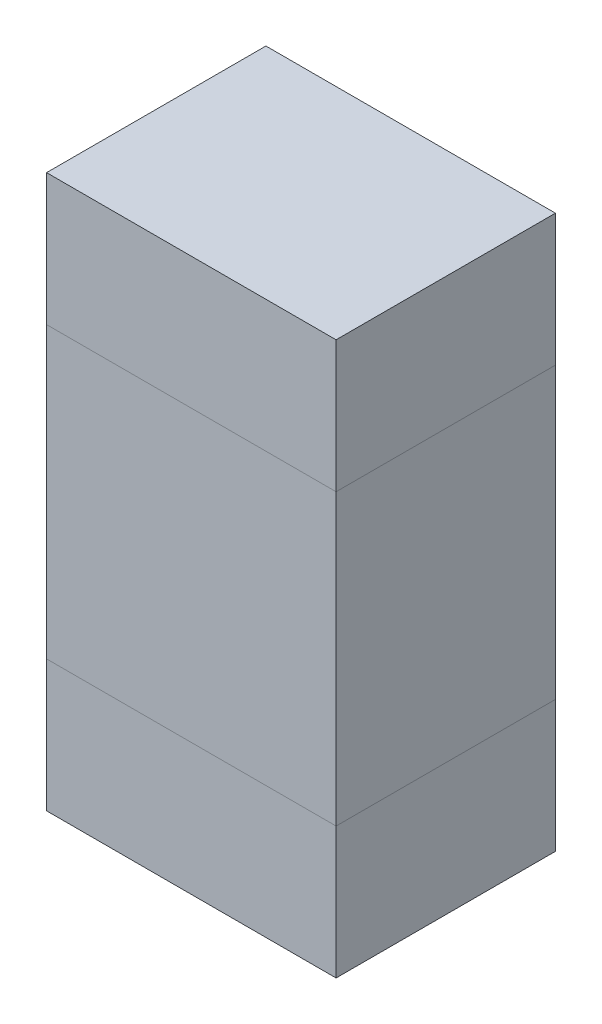
ISO-10303-21;
HEADER;
FILE_DESCRIPTION(('STEP AP214'),'2;1');
FILE_NAME('part.step','',(''),(''),'','','');
FILE_SCHEMA(('AUTOMOTIVE_DESIGN { 1 0 10303 214 1 1 1 1 }'));
ENDSEC;
DATA;
#1=APPLICATION_CONTEXT('core data for automotive mechanical design processes');
#2=APPLICATION_PROTOCOL_DEFINITION('international standard','automotive_design',2000,#1);
#3=PRODUCT_CONTEXT('',#1,'mechanical');
#4=PRODUCT('Part','Part','',(#3));
#5=PRODUCT_RELATED_PRODUCT_CATEGORY('part','',(#4));
#6=PRODUCT_DEFINITION_FORMATION('','',#4);
#7=PRODUCT_DEFINITION_CONTEXT('part definition',#1,'design');
#8=PRODUCT_DEFINITION('design','',#6,#7);
#9=PRODUCT_DEFINITION_SHAPE('','',#8);
#10=(LENGTH_UNIT() NAMED_UNIT(*) SI_UNIT(.MILLI.,.METRE.));
#11=(NAMED_UNIT(*) PLANE_ANGLE_UNIT() SI_UNIT($,.RADIAN.));
#12=(NAMED_UNIT(*) SI_UNIT($,.STERADIAN.) SOLID_ANGLE_UNIT());
#13=UNCERTAINTY_MEASURE_WITH_UNIT(LENGTH_MEASURE(1.E-05),#10,'distance_accuracy_value','');
#14=(GEOMETRIC_REPRESENTATION_CONTEXT(3) GLOBAL_UNCERTAINTY_ASSIGNED_CONTEXT((#13)) GLOBAL_UNIT_ASSIGNED_CONTEXT((#10,
#11,#12)) REPRESENTATION_CONTEXT('',''));
#15=CARTESIAN_POINT('',(0.,0.,0.));
#16=DIRECTION('',(0.,0.,1.));
#17=DIRECTION('',(1.,0.,0.));
#18=AXIS2_PLACEMENT_3D('',#15,#16,#17);
#19=CARTESIAN_POINT('',(4.114996417695,8.984999960195,0.2499995));
#20=DIRECTION('',(0.,0.,-1.));
#21=DIRECTION('',(0.,-1.,0.));
#22=AXIS2_PLACEMENT_3D('',#19,#20,#21);
#23=PLANE('',#22);
#24=DIRECTION('',(0.,1.,0.));
#25=VECTOR('',#24,1.);
#26=CARTESIAN_POINT('',(4.114996417695,8.984999960195,0.2499995));
#27=LINE('',#26,#25);
#28=CARTESIAN_POINT('',(4.114996417695,8.984999960195,0.2499995));
#29=VERTEX_POINT('',#28);
#30=CARTESIAN_POINT('',(4.114996417695,9.314996760195,0.2499995));
#31=VERTEX_POINT('',#30);
#32=EDGE_CURVE('P0_E94',#29,#31,#27,.T.);
#33=ORIENTED_EDGE('',*,*,#32,.T.);
#34=DIRECTION('',(-1.,0.,0.));
#35=VECTOR('',#34,1.);
#36=CARTESIAN_POINT('',(4.114996417695,9.314996760195,0.2499995));
#37=LINE('',#36,#35);
#38=CARTESIAN_POINT('',(3.785002157695,9.314996760195,0.2499995));
#39=VERTEX_POINT('',#38);
#40=EDGE_CURVE('P0_E74',#31,#39,#37,.T.);
#41=ORIENTED_EDGE('',*,*,#40,.T.);
#42=DIRECTION('',(0.,-1.,0.));
#43=VECTOR('',#42,1.);
#44=CARTESIAN_POINT('',(3.785002157695,9.314996760195,0.2499995));
#45=LINE('',#44,#43);
#46=CARTESIAN_POINT('',(3.785002157695,8.984999960195,0.2499995));
#47=VERTEX_POINT('',#46);
#48=EDGE_CURVE('P0_E88',#39,#47,#45,.T.);
#49=ORIENTED_EDGE('',*,*,#48,.T.);
#50=DIRECTION('',(1.,0.,0.));
#51=VECTOR('',#50,1.);
#52=CARTESIAN_POINT('',(3.785002157695,8.984999960195,0.2499995));
#53=LINE('',#52,#51);
#54=EDGE_CURVE('P0_E11',#47,#29,#53,.T.);
#55=ORIENTED_EDGE('',*,*,#54,.T.);
#56=EDGE_LOOP('',(#33,#41,#49,#55));
#57=FACE_BOUND('',#56,.T.);
#58=ADVANCED_FACE('P0_F17',(#57),#23,.F.);
#59=CARTESIAN_POINT('',(4.114996417695,8.984999960195,0.));
#60=DIRECTION('',(0.,0.,-1.));
#61=DIRECTION('',(0.,-1.,0.));
#62=AXIS2_PLACEMENT_3D('',#59,#60,#61);
#63=PLANE('',#62);
#64=DIRECTION('',(1.,0.,0.));
#65=VECTOR('',#64,1.);
#66=CARTESIAN_POINT('',(3.785002157695,8.984999960195,0.));
#67=LINE('',#66,#65);
#68=CARTESIAN_POINT('',(3.785002157695,8.984999960195,0.));
#69=VERTEX_POINT('',#68);
#70=CARTESIAN_POINT('',(4.114996417695,8.984999960195,0.));
#71=VERTEX_POINT('',#70);
#72=EDGE_CURVE('P0_E21',#69,#71,#67,.T.);
#73=ORIENTED_EDGE('',*,*,#72,.F.);
#74=DIRECTION('',(0.,-1.,0.));
#75=VECTOR('',#74,1.);
#76=CARTESIAN_POINT('',(3.785002157695,9.314996760195,0.));
#77=LINE('',#76,#75);
#78=CARTESIAN_POINT('',(3.785002157695,9.314996760195,0.));
#79=VERTEX_POINT('',#78);
#80=EDGE_CURVE('P0_E59',#79,#69,#77,.T.);
#81=ORIENTED_EDGE('',*,*,#80,.F.);
#82=DIRECTION('',(-1.,0.,0.));
#83=VECTOR('',#82,1.);
#84=CARTESIAN_POINT('',(4.114996417695,9.314996760195,0.));
#85=LINE('',#84,#83);
#86=CARTESIAN_POINT('',(4.114996417695,9.314996760195,0.));
#87=VERTEX_POINT('',#86);
#88=EDGE_CURVE('P0_E96',#87,#79,#85,.T.);
#89=ORIENTED_EDGE('',*,*,#88,.F.);
#90=DIRECTION('',(0.,1.,0.));
#91=VECTOR('',#90,1.);
#92=CARTESIAN_POINT('',(4.114996417695,8.984999960195,0.));
#93=LINE('',#92,#91);
#94=EDGE_CURVE('P0_E93',#71,#87,#93,.T.);
#95=ORIENTED_EDGE('',*,*,#94,.F.);
#96=EDGE_LOOP('',(#73,#81,#89,#95));
#97=FACE_BOUND('',#96,.T.);
#98=ADVANCED_FACE('P0_F19',(#97),#63,.T.);
#99=CARTESIAN_POINT('',(3.785002157695,8.984999960195,0.));
#100=DIRECTION('',(0.,1.,0.));
#101=DIRECTION('',(1.,0.,0.));
#102=AXIS2_PLACEMENT_3D('',#99,#100,#101);
#103=PLANE('',#102);
#104=ORIENTED_EDGE('',*,*,#72,.T.);
#105=DIRECTION('',(0.,0.,1.));
#106=VECTOR('',#105,1.);
#107=CARTESIAN_POINT('',(4.114996417695,8.984999960195,0.));
#108=LINE('',#107,#106);
#109=EDGE_CURVE('P0_E83',#71,#29,#108,.T.);
#110=ORIENTED_EDGE('',*,*,#109,.T.);
#111=ORIENTED_EDGE('',*,*,#54,.F.);
#112=DIRECTION('',(0.,0.,1.));
#113=VECTOR('',#112,1.);
#114=CARTESIAN_POINT('',(3.785002157695,8.984999960195,0.));
#115=LINE('',#114,#113);
#116=EDGE_CURVE('P0_E86',#69,#47,#115,.T.);
#117=ORIENTED_EDGE('',*,*,#116,.F.);
#118=EDGE_LOOP('',(#104,#110,#111,#117));
#119=FACE_BOUND('',#118,.T.);
#120=ADVANCED_FACE('P0_F82',(#119),#103,.F.);
#121=CARTESIAN_POINT('',(3.785002157695,9.314996760195,0.));
#122=DIRECTION('',(1.,0.,0.));
#123=DIRECTION('',(0.,1.,0.));
#124=AXIS2_PLACEMENT_3D('',#121,#122,#123);
#125=PLANE('',#124);
#126=ORIENTED_EDGE('',*,*,#80,.T.);
#127=ORIENTED_EDGE('',*,*,#116,.T.);
#128=ORIENTED_EDGE('',*,*,#48,.F.);
#129=DIRECTION('',(0.,0.,1.));
#130=VECTOR('',#129,1.);
#131=CARTESIAN_POINT('',(3.785002157695,9.314996760195,0.));
#132=LINE('',#131,#130);
#133=EDGE_CURVE('P0_E109',#79,#39,#132,.T.);
#134=ORIENTED_EDGE('',*,*,#133,.F.);
#135=EDGE_LOOP('',(#126,#127,#128,#134));
#136=FACE_BOUND('',#135,.T.);
#137=ADVANCED_FACE('P0_F121',(#136),#125,.F.);
#138=CARTESIAN_POINT('',(4.114996417695,9.314996760195,0.));
#139=DIRECTION('',(0.,-1.,0.));
#140=DIRECTION('',(0.,0.,-1.));
#141=AXIS2_PLACEMENT_3D('',#138,#139,#140);
#142=PLANE('',#141);
#143=ORIENTED_EDGE('',*,*,#88,.T.);
#144=ORIENTED_EDGE('',*,*,#133,.T.);
#145=ORIENTED_EDGE('',*,*,#40,.F.);
#146=DIRECTION('',(0.,0.,1.));
#147=VECTOR('',#146,1.);
#148=CARTESIAN_POINT('',(4.114996417695,9.314996760195,0.));
#149=LINE('',#148,#147);
#150=EDGE_CURVE('P0_E100',#87,#31,#149,.T.);
#151=ORIENTED_EDGE('',*,*,#150,.F.);
#152=EDGE_LOOP('',(#143,#144,#145,#151));
#153=FACE_BOUND('',#152,.T.);
#154=ADVANCED_FACE('P0_F122',(#153),#142,.F.);
#155=CARTESIAN_POINT('',(4.114996417695,8.984999960195,0.));
#156=DIRECTION('',(-1.,0.,0.));
#157=DIRECTION('',(0.,0.,1.));
#158=AXIS2_PLACEMENT_3D('',#155,#156,#157);
#159=PLANE('',#158);
#160=ORIENTED_EDGE('',*,*,#94,.T.);
#161=ORIENTED_EDGE('',*,*,#150,.T.);
#162=ORIENTED_EDGE('',*,*,#32,.F.);
#163=ORIENTED_EDGE('',*,*,#109,.F.);
#164=EDGE_LOOP('',(#160,#161,#162,#163));
#165=FACE_BOUND('',#164,.T.);
#166=ADVANCED_FACE('P0_F91',(#165),#159,.F.);
#167=CLOSED_SHELL('',(#58,#98,#120,#137,#154,#166));
#168=MANIFOLD_SOLID_BREP('P0_B1',#167);
#169=CARTESIAN_POINT('',(4.114996417695,8.985004156426,0.2499995));
#170=DIRECTION('',(0.,0.,-1.));
#171=DIRECTION('',(0.,-1.,0.));
#172=AXIS2_PLACEMENT_3D('',#169,#170,#171);
#173=PLANE('',#172);
#174=DIRECTION('',(-1.,0.,0.));
#175=VECTOR('',#174,1.);
#176=CARTESIAN_POINT('',(4.114996417695,8.985004156426,0.2499995));
#177=LINE('',#176,#175);
#178=CARTESIAN_POINT('',(4.114996417695,8.985004156426,0.2499995));
#179=VERTEX_POINT('',#178);
#180=CARTESIAN_POINT('',(3.784999617695,8.985004156426,0.2499995));
#181=VERTEX_POINT('',#180);
#182=EDGE_CURVE('P1_E90',#179,#181,#177,.T.);
#183=ORIENTED_EDGE('',*,*,#182,.T.);
#184=DIRECTION('',(0.,-1.,0.));
#185=VECTOR('',#184,1.);
#186=CARTESIAN_POINT('',(3.784999617695,8.985004156426,0.2499995));
#187=LINE('',#186,#185);
#188=CARTESIAN_POINT('',(3.784999617695,8.834996836426,0.2499995));
#189=VERTEX_POINT('',#188);
#190=EDGE_CURVE('P1_E85',#181,#189,#187,.T.);
#191=ORIENTED_EDGE('',*,*,#190,.T.);
#192=DIRECTION('',(1.,0.,0.));
#193=VECTOR('',#192,1.);
#194=CARTESIAN_POINT('',(3.784999617695,8.834996836426,0.2499995));
#195=LINE('',#194,#193);
#196=CARTESIAN_POINT('',(4.114996417695,8.834996836426,0.2499995));
#197=VERTEX_POINT('',#196);
#198=EDGE_CURVE('P1_E103',#189,#197,#195,.T.);
#199=ORIENTED_EDGE('',*,*,#198,.T.);
#200=DIRECTION('',(0.,1.,0.));
#201=VECTOR('',#200,1.);
#202=CARTESIAN_POINT('',(4.114996417695,8.834996836426,0.2499995));
#203=LINE('',#202,#201);
#204=EDGE_CURVE('P1_E11',#197,#179,#203,.T.);
#205=ORIENTED_EDGE('',*,*,#204,.T.);
#206=EDGE_LOOP('',(#183,#191,#199,#205));
#207=FACE_BOUND('',#206,.T.);
#208=ADVANCED_FACE('P1_F17',(#207),#173,.F.);
#209=CARTESIAN_POINT('',(4.114996417695,8.985004156426,0.));
#210=DIRECTION('',(0.,0.,-1.));
#211=DIRECTION('',(0.,-1.,0.));
#212=AXIS2_PLACEMENT_3D('',#209,#210,#211);
#213=PLANE('',#212);
#214=DIRECTION('',(0.,1.,0.));
#215=VECTOR('',#214,1.);
#216=CARTESIAN_POINT('',(4.114996417695,8.834996836426,0.));
#217=LINE('',#216,#215);
#218=CARTESIAN_POINT('',(4.114996417695,8.834996836426,0.));
#219=VERTEX_POINT('',#218);
#220=CARTESIAN_POINT('',(4.114996417695,8.985004156426,0.));
#221=VERTEX_POINT('',#220);
#222=EDGE_CURVE('P1_E25',#219,#221,#217,.T.);
#223=ORIENTED_EDGE('',*,*,#222,.F.);
#224=DIRECTION('',(1.,0.,0.));
#225=VECTOR('',#224,1.);
#226=CARTESIAN_POINT('',(3.784999617695,8.834996836426,0.));
#227=LINE('',#226,#225);
#228=CARTESIAN_POINT('',(3.784999617695,8.834996836426,0.));
#229=VERTEX_POINT('',#228);
#230=EDGE_CURVE('P1_E73',#229,#219,#227,.T.);
#231=ORIENTED_EDGE('',*,*,#230,.F.);
#232=DIRECTION('',(0.,-1.,0.));
#233=VECTOR('',#232,1.);
#234=CARTESIAN_POINT('',(3.784999617695,8.985004156426,0.));
#235=LINE('',#234,#233);
#236=CARTESIAN_POINT('',(3.784999617695,8.985004156426,0.));
#237=VERTEX_POINT('',#236);
#238=EDGE_CURVE('P1_E67',#237,#229,#235,.T.);
#239=ORIENTED_EDGE('',*,*,#238,.F.);
#240=DIRECTION('',(-1.,0.,0.));
#241=VECTOR('',#240,1.);
#242=CARTESIAN_POINT('',(4.114996417695,8.985004156426,0.));
#243=LINE('',#242,#241);
#244=EDGE_CURVE('P1_E71',#221,#237,#243,.T.);
#245=ORIENTED_EDGE('',*,*,#244,.F.);
#246=EDGE_LOOP('',(#223,#231,#239,#245));
#247=FACE_BOUND('',#246,.T.);
#248=ADVANCED_FACE('P1_F69',(#247),#213,.T.);
#249=CARTESIAN_POINT('',(4.114996417695,8.834996836426,0.));
#250=DIRECTION('',(-1.,0.,0.));
#251=DIRECTION('',(0.,0.,1.));
#252=AXIS2_PLACEMENT_3D('',#249,#250,#251);
#253=PLANE('',#252);
#254=ORIENTED_EDGE('',*,*,#222,.T.);
#255=DIRECTION('',(0.,0.,1.));
#256=VECTOR('',#255,1.);
#257=CARTESIAN_POINT('',(4.114996417695,8.985004156426,0.));
#258=LINE('',#257,#256);
#259=EDGE_CURVE('P1_E79',#221,#179,#258,.T.);
#260=ORIENTED_EDGE('',*,*,#259,.T.);
#261=ORIENTED_EDGE('',*,*,#204,.F.);
#262=DIRECTION('',(0.,0.,1.));
#263=VECTOR('',#262,1.);
#264=CARTESIAN_POINT('',(4.114996417695,8.834996836426,0.));
#265=LINE('',#264,#263);
#266=EDGE_CURVE('P1_E107',#219,#197,#265,.T.);
#267=ORIENTED_EDGE('',*,*,#266,.F.);
#268=EDGE_LOOP('',(#254,#260,#261,#267));
#269=FACE_BOUND('',#268,.T.);
#270=ADVANCED_FACE('P1_F119',(#269),#253,.F.);
#271=CARTESIAN_POINT('',(3.784999617695,8.834996836426,0.));
#272=DIRECTION('',(0.,1.,0.));
#273=DIRECTION('',(1.,0.,0.));
#274=AXIS2_PLACEMENT_3D('',#271,#272,#273);
#275=PLANE('',#274);
#276=ORIENTED_EDGE('',*,*,#230,.T.);
#277=ORIENTED_EDGE('',*,*,#266,.T.);
#278=ORIENTED_EDGE('',*,*,#198,.F.);
#279=DIRECTION('',(0.,0.,1.));
#280=VECTOR('',#279,1.);
#281=CARTESIAN_POINT('',(3.784999617695,8.834996836426,0.));
#282=LINE('',#281,#280);
#283=EDGE_CURVE('P1_E78',#229,#189,#282,.T.);
#284=ORIENTED_EDGE('',*,*,#283,.F.);
#285=EDGE_LOOP('',(#276,#277,#278,#284));
#286=FACE_BOUND('',#285,.T.);
#287=ADVANCED_FACE('P1_F118',(#286),#275,.F.);
#288=CARTESIAN_POINT('',(3.784999617695,8.985004156426,0.));
#289=DIRECTION('',(1.,0.,0.));
#290=DIRECTION('',(0.,1.,0.));
#291=AXIS2_PLACEMENT_3D('',#288,#289,#290);
#292=PLANE('',#291);
#293=ORIENTED_EDGE('',*,*,#238,.T.);
#294=ORIENTED_EDGE('',*,*,#283,.T.);
#295=ORIENTED_EDGE('',*,*,#190,.F.);
#296=DIRECTION('',(0.,0.,1.));
#297=VECTOR('',#296,1.);
#298=CARTESIAN_POINT('',(3.784999617695,8.985004156426,0.));
#299=LINE('',#298,#297);
#300=EDGE_CURVE('P1_E82',#237,#181,#299,.T.);
#301=ORIENTED_EDGE('',*,*,#300,.F.);
#302=EDGE_LOOP('',(#293,#294,#295,#301));
#303=FACE_BOUND('',#302,.T.);
#304=ADVANCED_FACE('P1_F83',(#303),#292,.F.);
#305=CARTESIAN_POINT('',(4.114996417695,8.985004156426,0.));
#306=DIRECTION('',(0.,-1.,0.));
#307=DIRECTION('',(0.,0.,-1.));
#308=AXIS2_PLACEMENT_3D('',#305,#306,#307);
#309=PLANE('',#308);
#310=ORIENTED_EDGE('',*,*,#244,.T.);
#311=ORIENTED_EDGE('',*,*,#300,.T.);
#312=ORIENTED_EDGE('',*,*,#182,.F.);
#313=ORIENTED_EDGE('',*,*,#259,.F.);
#314=EDGE_LOOP('',(#310,#311,#312,#313));
#315=FACE_BOUND('',#314,.T.);
#316=ADVANCED_FACE('P1_F93',(#315),#309,.F.);
#317=CLOSED_SHELL('',(#208,#248,#270,#287,#304,#316));
#318=MANIFOLD_SOLID_BREP('P1_B1',#317);
#319=CARTESIAN_POINT('',(4.114996417695,9.464999883965,0.2499995));
#320=DIRECTION('',(0.,0.,-1.));
#321=DIRECTION('',(0.,-1.,0.));
#322=AXIS2_PLACEMENT_3D('',#319,#320,#321);
#323=PLANE('',#322);
#324=DIRECTION('',(-1.,0.,0.));
#325=VECTOR('',#324,1.);
#326=CARTESIAN_POINT('',(4.114996417695,9.464999883965,0.2499995));
#327=LINE('',#326,#325);
#328=CARTESIAN_POINT('',(4.114996417695,9.464999883965,0.2499995));
#329=VERTEX_POINT('',#328);
#330=CARTESIAN_POINT('',(3.784999617695,9.464999883965,0.2499995));
#331=VERTEX_POINT('',#330);
#332=EDGE_CURVE('P2_E82',#329,#331,#327,.T.);
#333=ORIENTED_EDGE('',*,*,#332,.T.);
#334=DIRECTION('',(0.,-1.,0.));
#335=VECTOR('',#334,1.);
#336=CARTESIAN_POINT('',(3.784999617695,9.464999883965,0.2499995));
#337=LINE('',#336,#335);
#338=CARTESIAN_POINT('',(3.784999617695,9.314992563965,0.2499995));
#339=VERTEX_POINT('',#338);
#340=EDGE_CURVE('P2_E99',#331,#339,#337,.T.);
#341=ORIENTED_EDGE('',*,*,#340,.T.);
#342=DIRECTION('',(1.,0.,0.));
#343=VECTOR('',#342,1.);
#344=CARTESIAN_POINT('',(3.784999617695,9.314992563965,0.2499995));
#345=LINE('',#344,#343);
#346=CARTESIAN_POINT('',(4.114996417695,9.314992563965,0.2499995));
#347=VERTEX_POINT('',#346);
#348=EDGE_CURVE('P2_E20',#339,#347,#345,.T.);
#349=ORIENTED_EDGE('',*,*,#348,.T.);
#350=DIRECTION('',(0.,1.,0.));
#351=VECTOR('',#350,1.);
#352=CARTESIAN_POINT('',(4.114996417695,9.314992563965,0.2499995));
#353=LINE('',#352,#351);
#354=EDGE_CURVE('P2_E11',#347,#329,#353,.T.);
#355=ORIENTED_EDGE('',*,*,#354,.T.);
#356=EDGE_LOOP('',(#333,#341,#349,#355));
#357=FACE_BOUND('',#356,.T.);
#358=ADVANCED_FACE('P2_F17',(#357),#323,.F.);
#359=CARTESIAN_POINT('',(4.114996417695,9.464999883965,0.));
#360=DIRECTION('',(0.,0.,-1.));
#361=DIRECTION('',(0.,-1.,0.));
#362=AXIS2_PLACEMENT_3D('',#359,#360,#361);
#363=PLANE('',#362);
#364=DIRECTION('',(0.,1.,0.));
#365=VECTOR('',#364,1.);
#366=CARTESIAN_POINT('',(4.114996417695,9.314992563965,0.));
#367=LINE('',#366,#365);
#368=CARTESIAN_POINT('',(4.114996417695,9.314992563965,0.));
#369=VERTEX_POINT('',#368);
#370=CARTESIAN_POINT('',(4.114996417695,9.464999883965,0.));
#371=VERTEX_POINT('',#370);
#372=EDGE_CURVE('P2_E26',#369,#371,#367,.T.);
#373=ORIENTED_EDGE('',*,*,#372,.F.);
#374=DIRECTION('',(1.,0.,0.));
#375=VECTOR('',#374,1.);
#376=CARTESIAN_POINT('',(3.784999617695,9.314992563965,0.));
#377=LINE('',#376,#375);
#378=CARTESIAN_POINT('',(3.784999617695,9.314992563965,0.));
#379=VERTEX_POINT('',#378);
#380=EDGE_CURVE('P2_E96',#379,#369,#377,.T.);
#381=ORIENTED_EDGE('',*,*,#380,.F.);
#382=DIRECTION('',(0.,-1.,0.));
#383=VECTOR('',#382,1.);
#384=CARTESIAN_POINT('',(3.784999617695,9.464999883965,0.));
#385=LINE('',#384,#383);
#386=CARTESIAN_POINT('',(3.784999617695,9.464999883965,0.));
#387=VERTEX_POINT('',#386);
#388=EDGE_CURVE('P2_E84',#387,#379,#385,.T.);
#389=ORIENTED_EDGE('',*,*,#388,.F.);
#390=DIRECTION('',(-1.,0.,0.));
#391=VECTOR('',#390,1.);
#392=CARTESIAN_POINT('',(4.114996417695,9.464999883965,0.));
#393=LINE('',#392,#391);
#394=EDGE_CURVE('P2_E80',#371,#387,#393,.T.);
#395=ORIENTED_EDGE('',*,*,#394,.F.);
#396=EDGE_LOOP('',(#373,#381,#389,#395));
#397=FACE_BOUND('',#396,.T.);
#398=ADVANCED_FACE('P2_F86',(#397),#363,.T.);
#399=CARTESIAN_POINT('',(4.114996417695,9.314992563965,0.));
#400=DIRECTION('',(-1.,0.,0.));
#401=DIRECTION('',(0.,0.,1.));
#402=AXIS2_PLACEMENT_3D('',#399,#400,#401);
#403=PLANE('',#402);
#404=ORIENTED_EDGE('',*,*,#372,.T.);
#405=DIRECTION('',(0.,0.,1.));
#406=VECTOR('',#405,1.);
#407=CARTESIAN_POINT('',(4.114996417695,9.464999883965,0.));
#408=LINE('',#407,#406);
#409=EDGE_CURVE('P2_E69',#371,#329,#408,.T.);
#410=ORIENTED_EDGE('',*,*,#409,.T.);
#411=ORIENTED_EDGE('',*,*,#354,.F.);
#412=DIRECTION('',(0.,0.,1.));
#413=VECTOR('',#412,1.);
#414=CARTESIAN_POINT('',(4.114996417695,9.314992563965,0.));
#415=LINE('',#414,#413);
#416=EDGE_CURVE('P2_E72',#369,#347,#415,.T.);
#417=ORIENTED_EDGE('',*,*,#416,.F.);
#418=EDGE_LOOP('',(#404,#410,#411,#417));
#419=FACE_BOUND('',#418,.T.);
#420=ADVANCED_FACE('P2_F68',(#419),#403,.F.);
#421=CARTESIAN_POINT('',(3.784999617695,9.314992563965,0.));
#422=DIRECTION('',(0.,1.,0.));
#423=DIRECTION('',(1.,0.,0.));
#424=AXIS2_PLACEMENT_3D('',#421,#422,#423);
#425=PLANE('',#424);
#426=ORIENTED_EDGE('',*,*,#380,.T.);
#427=ORIENTED_EDGE('',*,*,#416,.T.);
#428=ORIENTED_EDGE('',*,*,#348,.F.);
#429=DIRECTION('',(0.,0.,1.));
#430=VECTOR('',#429,1.);
#431=CARTESIAN_POINT('',(3.784999617695,9.314992563965,0.));
#432=LINE('',#431,#430);
#433=EDGE_CURVE('P2_E106',#379,#339,#432,.T.);
#434=ORIENTED_EDGE('',*,*,#433,.F.);
#435=EDGE_LOOP('',(#426,#427,#428,#434));
#436=FACE_BOUND('',#435,.T.);
#437=ADVANCED_FACE('P2_F118',(#436),#425,.F.);
#438=CARTESIAN_POINT('',(3.784999617695,9.464999883965,0.));
#439=DIRECTION('',(1.,0.,0.));
#440=DIRECTION('',(0.,1.,0.));
#441=AXIS2_PLACEMENT_3D('',#438,#439,#440);
#442=PLANE('',#441);
#443=ORIENTED_EDGE('',*,*,#388,.T.);
#444=ORIENTED_EDGE('',*,*,#433,.T.);
#445=ORIENTED_EDGE('',*,*,#340,.F.);
#446=DIRECTION('',(0.,0.,1.));
#447=VECTOR('',#446,1.);
#448=CARTESIAN_POINT('',(3.784999617695,9.464999883965,0.));
#449=LINE('',#448,#447);
#450=EDGE_CURVE('P2_E90',#387,#331,#449,.T.);
#451=ORIENTED_EDGE('',*,*,#450,.F.);
#452=EDGE_LOOP('',(#443,#444,#445,#451));
#453=FACE_BOUND('',#452,.T.);
#454=ADVANCED_FACE('P2_F116',(#453),#442,.F.);
#455=CARTESIAN_POINT('',(4.114996417695,9.464999883965,0.));
#456=DIRECTION('',(0.,-1.,0.));
#457=DIRECTION('',(0.,0.,-1.));
#458=AXIS2_PLACEMENT_3D('',#455,#456,#457);
#459=PLANE('',#458);
#460=ORIENTED_EDGE('',*,*,#394,.T.);
#461=ORIENTED_EDGE('',*,*,#450,.T.);
#462=ORIENTED_EDGE('',*,*,#332,.F.);
#463=ORIENTED_EDGE('',*,*,#409,.F.);
#464=EDGE_LOOP('',(#460,#461,#462,#463));
#465=FACE_BOUND('',#464,.T.);
#466=ADVANCED_FACE('P2_F78',(#465),#459,.F.);
#467=CLOSED_SHELL('',(#358,#398,#420,#437,#454,#466));
#468=MANIFOLD_SOLID_BREP('P2_B1',#467);
#469=ADVANCED_BREP_SHAPE_REPRESENTATION('',(#18,#168,#318,#468),#14);
#470=SHAPE_DEFINITION_REPRESENTATION(#9,#469);
ENDSEC;
END-ISO-10303-21;
